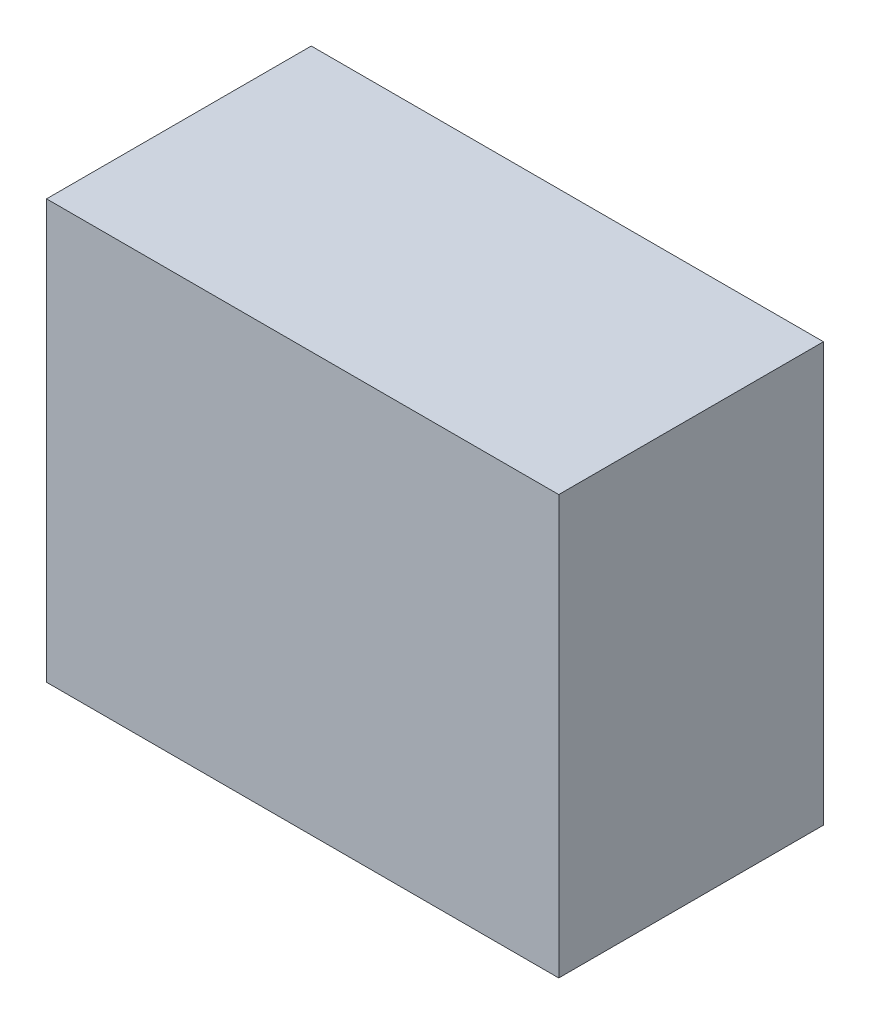
ISO-10303-21;
HEADER;
FILE_DESCRIPTION(('STEP AP214'),'2;1');
FILE_NAME('part.step','',(''),(''),'','','');
FILE_SCHEMA(('AUTOMOTIVE_DESIGN { 1 0 10303 214 1 1 1 1 }'));
ENDSEC;
DATA;
#1=APPLICATION_CONTEXT('core data for automotive mechanical design processes');
#2=APPLICATION_PROTOCOL_DEFINITION('international standard','automotive_design',2000,#1);
#3=PRODUCT_CONTEXT('',#1,'mechanical');
#4=PRODUCT('Part','Part','',(#3));
#5=PRODUCT_RELATED_PRODUCT_CATEGORY('part','',(#4));
#6=PRODUCT_DEFINITION_FORMATION('','',#4);
#7=PRODUCT_DEFINITION_CONTEXT('part definition',#1,'design');
#8=PRODUCT_DEFINITION('design','',#6,#7);
#9=PRODUCT_DEFINITION_SHAPE('','',#8);
#10=(LENGTH_UNIT() NAMED_UNIT(*) SI_UNIT(.MILLI.,.METRE.));
#11=(NAMED_UNIT(*) PLANE_ANGLE_UNIT() SI_UNIT($,.RADIAN.));
#12=(NAMED_UNIT(*) SI_UNIT($,.STERADIAN.) SOLID_ANGLE_UNIT());
#13=UNCERTAINTY_MEASURE_WITH_UNIT(LENGTH_MEASURE(1.E-05),#10,'distance_accuracy_value','');
#14=(GEOMETRIC_REPRESENTATION_CONTEXT(3) GLOBAL_UNCERTAINTY_ASSIGNED_CONTEXT((#13)) GLOBAL_UNIT_ASSIGNED_CONTEXT((#10,
#11,#12)) REPRESENTATION_CONTEXT('',''));
#15=CARTESIAN_POINT('',(0.,0.,0.));
#16=DIRECTION('',(0.,0.,1.));
#17=DIRECTION('',(1.,0.,0.));
#18=AXIS2_PLACEMENT_3D('',#15,#16,#17);
#19=CARTESIAN_POINT('',(0.58050684,0.47449232,0.5999988));
#20=DIRECTION('',(0.,0.,1.));
#21=DIRECTION('',(1.,0.,0.));
#22=AXIS2_PLACEMENT_3D('',#19,#20,#21);
#23=PLANE('',#22);
#24=DIRECTION('',(1.,0.,0.));
#25=VECTOR('',#24,1.);
#26=CARTESIAN_POINT('',(0.58050684,-0.47448978,0.5999988));
#27=LINE('',#26,#25);
#28=CARTESIAN_POINT('',(0.58050684,-0.47448978,0.5999988));
#29=VERTEX_POINT('',#28);
#30=CARTESIAN_POINT('',(-0.58050684,-0.47448978,0.5999988));
#31=VERTEX_POINT('',#30);
#32=EDGE_CURVE('E53',#29,#31,#27,.F.);
#33=ORIENTED_EDGE('',*,*,#32,.F.);
#34=DIRECTION('',(0.,1.,0.));
#35=VECTOR('',#34,1.);
#36=CARTESIAN_POINT('',(0.58050684,0.47449232,0.5999988));
#37=LINE('',#36,#35);
#38=CARTESIAN_POINT('',(0.58050684,0.47449232,0.5999988));
#39=VERTEX_POINT('',#38);
#40=EDGE_CURVE('E68',#39,#29,#37,.F.);
#41=ORIENTED_EDGE('',*,*,#40,.F.);
#42=DIRECTION('',(1.,0.,0.));
#43=VECTOR('',#42,1.);
#44=CARTESIAN_POINT('',(-0.58050684,0.47449232,0.5999988));
#45=LINE('',#44,#43);
#46=CARTESIAN_POINT('',(-0.58050684,0.47449232,0.5999988));
#47=VERTEX_POINT('',#46);
#48=EDGE_CURVE('E20',#47,#39,#45,.T.);
#49=ORIENTED_EDGE('',*,*,#48,.F.);
#50=DIRECTION('',(0.,1.,0.));
#51=VECTOR('',#50,1.);
#52=CARTESIAN_POINT('',(-0.58050684,-0.47448978,0.5999988));
#53=LINE('',#52,#51);
#54=EDGE_CURVE('E58',#31,#47,#53,.T.);
#55=ORIENTED_EDGE('',*,*,#54,.F.);
#56=EDGE_LOOP('',(#33,#41,#49,#55));
#57=FACE_BOUND('',#56,.T.);
#58=ADVANCED_FACE('F17',(#57),#23,.T.);
#59=CARTESIAN_POINT('',(-0.58050684,0.47449232,0.));
#60=DIRECTION('',(0.,1.,0.));
#61=DIRECTION('',(0.,0.,1.));
#62=AXIS2_PLACEMENT_3D('',#59,#60,#61);
#63=PLANE('',#62);
#64=DIRECTION('',(0.,0.,-1.));
#65=VECTOR('',#64,1.);
#66=CARTESIAN_POINT('',(0.58050684,0.47449232,0.));
#67=LINE('',#66,#65);
#68=CARTESIAN_POINT('',(0.58050684,0.47449232,0.));
#69=VERTEX_POINT('',#68);
#70=EDGE_CURVE('E79',#69,#39,#67,.F.);
#71=ORIENTED_EDGE('',*,*,#70,.F.);
#72=DIRECTION('',(1.,0.,0.));
#73=VECTOR('',#72,1.);
#74=CARTESIAN_POINT('',(0.58050684,0.47449232,0.));
#75=LINE('',#74,#73);
#76=CARTESIAN_POINT('',(-0.58050684,0.47449232,0.));
#77=VERTEX_POINT('',#76);
#78=EDGE_CURVE('E74',#69,#77,#75,.F.);
#79=ORIENTED_EDGE('',*,*,#78,.T.);
#80=DIRECTION('',(0.,0.,1.));
#81=VECTOR('',#80,1.);
#82=CARTESIAN_POINT('',(-0.58050684,0.47449232,0.));
#83=LINE('',#82,#81);
#84=EDGE_CURVE('E63',#47,#77,#83,.F.);
#85=ORIENTED_EDGE('',*,*,#84,.F.);
#86=ORIENTED_EDGE('',*,*,#48,.T.);
#87=EDGE_LOOP('',(#71,#79,#85,#86));
#88=FACE_BOUND('',#87,.T.);
#89=ADVANCED_FACE('F73',(#88),#63,.T.);
#90=CARTESIAN_POINT('',(-0.58050684,-0.47448978,0.));
#91=DIRECTION('',(-1.,0.,0.));
#92=DIRECTION('',(0.,0.,1.));
#93=AXIS2_PLACEMENT_3D('',#90,#91,#92);
#94=PLANE('',#93);
#95=ORIENTED_EDGE('',*,*,#84,.T.);
#96=DIRECTION('',(0.,1.,0.));
#97=VECTOR('',#96,1.);
#98=CARTESIAN_POINT('',(-0.58050684,0.47449232,0.));
#99=LINE('',#98,#97);
#100=CARTESIAN_POINT('',(-0.58050684,-0.47448978,0.));
#101=VERTEX_POINT('',#100);
#102=EDGE_CURVE('E84',#77,#101,#99,.F.);
#103=ORIENTED_EDGE('',*,*,#102,.T.);
#104=DIRECTION('',(0.,0.,-1.));
#105=VECTOR('',#104,1.);
#106=CARTESIAN_POINT('',(-0.58050684,-0.47448978,0.));
#107=LINE('',#106,#105);
#108=EDGE_CURVE('E65',#31,#101,#107,.T.);
#109=ORIENTED_EDGE('',*,*,#108,.F.);
#110=ORIENTED_EDGE('',*,*,#54,.T.);
#111=EDGE_LOOP('',(#95,#103,#109,#110));
#112=FACE_BOUND('',#111,.T.);
#113=ADVANCED_FACE('F60',(#112),#94,.T.);
#114=CARTESIAN_POINT('',(0.58050684,-0.47448978,0.));
#115=DIRECTION('',(0.,-1.,0.));
#116=DIRECTION('',(0.,0.,-1.));
#117=AXIS2_PLACEMENT_3D('',#114,#115,#116);
#118=PLANE('',#117);
#119=ORIENTED_EDGE('',*,*,#108,.T.);
#120=DIRECTION('',(1.,0.,0.));
#121=VECTOR('',#120,1.);
#122=CARTESIAN_POINT('',(0.58050684,-0.47448978,0.));
#123=LINE('',#122,#121);
#124=CARTESIAN_POINT('',(0.58050684,-0.47448978,0.));
#125=VERTEX_POINT('',#124);
#126=EDGE_CURVE('E26',#101,#125,#123,.T.);
#127=ORIENTED_EDGE('',*,*,#126,.T.);
#128=DIRECTION('',(0.,0.,-1.));
#129=VECTOR('',#128,1.);
#130=CARTESIAN_POINT('',(0.58050684,-0.47448978,0.));
#131=LINE('',#130,#129);
#132=EDGE_CURVE('E34',#29,#125,#131,.T.);
#133=ORIENTED_EDGE('',*,*,#132,.F.);
#134=ORIENTED_EDGE('',*,*,#32,.T.);
#135=EDGE_LOOP('',(#119,#127,#133,#134));
#136=FACE_BOUND('',#135,.T.);
#137=ADVANCED_FACE('F88',(#136),#118,.T.);
#138=CARTESIAN_POINT('',(0.58050684,0.47449232,0.));
#139=DIRECTION('',(1.,0.,0.));
#140=DIRECTION('',(0.,0.,-1.));
#141=AXIS2_PLACEMENT_3D('',#138,#139,#140);
#142=PLANE('',#141);
#143=ORIENTED_EDGE('',*,*,#132,.T.);
#144=DIRECTION('',(0.,1.,0.));
#145=VECTOR('',#144,1.);
#146=CARTESIAN_POINT('',(0.58050684,0.47449232,0.));
#147=LINE('',#146,#145);
#148=EDGE_CURVE('E11',#125,#69,#147,.T.);
#149=ORIENTED_EDGE('',*,*,#148,.T.);
#150=ORIENTED_EDGE('',*,*,#70,.T.);
#151=ORIENTED_EDGE('',*,*,#40,.T.);
#152=EDGE_LOOP('',(#143,#149,#150,#151));
#153=FACE_BOUND('',#152,.T.);
#154=ADVANCED_FACE('F91',(#153),#142,.T.);
#155=CARTESIAN_POINT('',(0.58050684,0.47449232,0.));
#156=DIRECTION('',(0.,0.,1.));
#157=DIRECTION('',(1.,0.,0.));
#158=AXIS2_PLACEMENT_3D('',#155,#156,#157);
#159=PLANE('',#158);
#160=ORIENTED_EDGE('',*,*,#126,.F.);
#161=ORIENTED_EDGE('',*,*,#102,.F.);
#162=ORIENTED_EDGE('',*,*,#78,.F.);
#163=ORIENTED_EDGE('',*,*,#148,.F.);
#164=EDGE_LOOP('',(#160,#161,#162,#163));
#165=FACE_BOUND('',#164,.T.);
#166=ADVANCED_FACE('F90',(#165),#159,.F.);
#167=CLOSED_SHELL('',(#58,#89,#113,#137,#154,#166));
#168=MANIFOLD_SOLID_BREP('B1',#167);
#169=ADVANCED_BREP_SHAPE_REPRESENTATION('',(#18,#168),#14);
#170=SHAPE_DEFINITION_REPRESENTATION(#9,#169);
ENDSEC;
END-ISO-10303-21;
